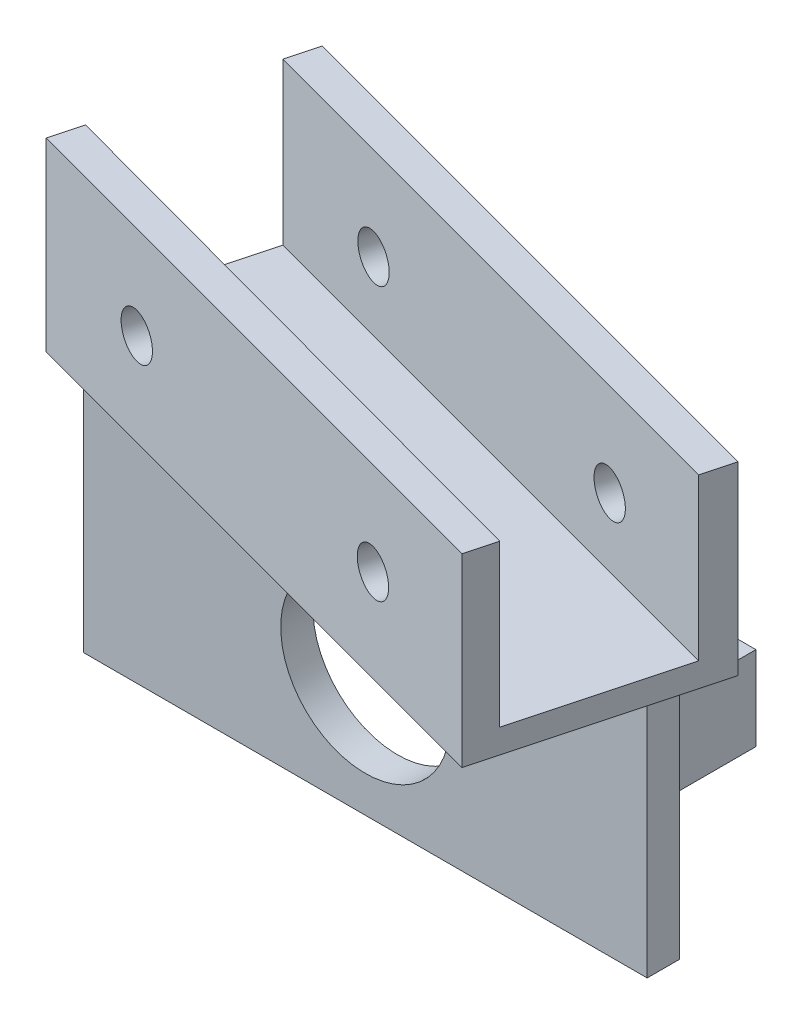
ISO-10303-21;
HEADER;
FILE_DESCRIPTION(('STEP AP214'),'2;1');
FILE_NAME('part.step','',(''),(''),'','','');
FILE_SCHEMA(('AUTOMOTIVE_DESIGN { 1 0 10303 214 1 1 1 1 }'));
ENDSEC;
DATA;
#1=APPLICATION_CONTEXT('core data for automotive mechanical design processes');
#2=APPLICATION_PROTOCOL_DEFINITION('international standard','automotive_design',2000,#1);
#3=PRODUCT_CONTEXT('',#1,'mechanical');
#4=PRODUCT('Part','Part','',(#3));
#5=PRODUCT_RELATED_PRODUCT_CATEGORY('part','',(#4));
#6=PRODUCT_DEFINITION_FORMATION('','',#4);
#7=PRODUCT_DEFINITION_CONTEXT('part definition',#1,'design');
#8=PRODUCT_DEFINITION('design','',#6,#7);
#9=PRODUCT_DEFINITION_SHAPE('','',#8);
#10=(LENGTH_UNIT() NAMED_UNIT(*) SI_UNIT(.MILLI.,.METRE.));
#11=(NAMED_UNIT(*) PLANE_ANGLE_UNIT() SI_UNIT($,.RADIAN.));
#12=(NAMED_UNIT(*) SI_UNIT($,.STERADIAN.) SOLID_ANGLE_UNIT());
#13=UNCERTAINTY_MEASURE_WITH_UNIT(LENGTH_MEASURE(1.E-05),#10,'distance_accuracy_value','');
#14=(GEOMETRIC_REPRESENTATION_CONTEXT(3) GLOBAL_UNCERTAINTY_ASSIGNED_CONTEXT((#13)) GLOBAL_UNIT_ASSIGNED_CONTEXT((#10,
#11,#12)) REPRESENTATION_CONTEXT('',''));
#15=CARTESIAN_POINT('',(0.,0.,0.));
#16=DIRECTION('',(0.,0.,1.));
#17=DIRECTION('',(1.,0.,0.));
#18=AXIS2_PLACEMENT_3D('',#15,#16,#17);
#19=CARTESIAN_POINT('',(0.,0.,0.));
#20=DIRECTION('',(0.,0.,1.));
#21=DIRECTION('',(1.,0.,0.));
#22=AXIS2_PLACEMENT_3D('',#19,#20,#21);
#23=PLANE('',#22);
#24=DIRECTION('',(0.,-1.,0.));
#25=VECTOR('',#24,1.);
#26=CARTESIAN_POINT('',(62.5000000000001,-8.93838300419958,0.));
#27=LINE('',#26,#25);
#28=CARTESIAN_POINT('',(62.5000000000001,-8.93838300419958,0.));
#29=VERTEX_POINT('',#28);
#30=CARTESIAN_POINT('',(62.5000000000001,-19.3737653444259,0.));
#31=VERTEX_POINT('',#30);
#32=EDGE_CURVE('E281',#29,#31,#27,.T.);
#33=ORIENTED_EDGE('',*,*,#32,.F.);
#34=DIRECTION('',(1.,0.,0.));
#35=VECTOR('',#34,1.);
#36=CARTESIAN_POINT('',(62.5000000000001,-8.93838300419958,0.));
#37=LINE('',#36,#35);
#38=CARTESIAN_POINT('',(54.3490123333825,-8.93838300419958,0.));
#39=VERTEX_POINT('',#38);
#40=EDGE_CURVE('E314',#39,#29,#37,.T.);
#41=ORIENTED_EDGE('',*,*,#40,.F.);
#42=DIRECTION('',(0.,1.,0.));
#43=VECTOR('',#42,1.);
#44=CARTESIAN_POINT('',(54.3490123333825,-8.93838300419958,0.));
#45=LINE('',#44,#43);
#46=CARTESIAN_POINT('',(54.3490123333825,-19.3737653444259,0.));
#47=VERTEX_POINT('',#46);
#48=EDGE_CURVE('E319',#47,#39,#45,.T.);
#49=ORIENTED_EDGE('',*,*,#48,.F.);
#50=DIRECTION('',(-1.,0.,0.));
#51=VECTOR('',#50,1.);
#52=CARTESIAN_POINT('',(54.3490123333825,-19.3737653444259,0.));
#53=LINE('',#52,#51);
#54=EDGE_CURVE('E325',#31,#47,#53,.T.);
#55=ORIENTED_EDGE('',*,*,#54,.F.);
#56=EDGE_LOOP('',(#33,#41,#49,#55));
#57=FACE_BOUND('',#56,.T.);
#58=DIRECTION('',(0.,-1.,0.));
#59=VECTOR('',#58,1.);
#60=CARTESIAN_POINT('',(0.,0.,0.));
#61=LINE('',#60,#59);
#62=CARTESIAN_POINT('',(0.,0.,0.));
#63=VERTEX_POINT('',#62);
#64=CARTESIAN_POINT('',(0.,-30.,0.));
#65=VERTEX_POINT('',#64);
#66=EDGE_CURVE('E340',#63,#65,#61,.T.);
#67=ORIENTED_EDGE('',*,*,#66,.F.);
#68=DIRECTION('',(-1.,0.,0.));
#69=VECTOR('',#68,1.);
#70=CARTESIAN_POINT('',(0.,0.,0.));
#71=LINE('',#70,#69);
#72=CARTESIAN_POINT('',(70.,0.,0.));
#73=VERTEX_POINT('',#72);
#74=EDGE_CURVE('E341',#73,#63,#71,.T.);
#75=ORIENTED_EDGE('',*,*,#74,.F.);
#76=DIRECTION('',(0.,1.,0.));
#77=VECTOR('',#76,1.);
#78=CARTESIAN_POINT('',(70.,0.,0.));
#79=LINE('',#78,#77);
#80=CARTESIAN_POINT('',(70.,-30.,0.));
#81=VERTEX_POINT('',#80);
#82=EDGE_CURVE('E352',#81,#73,#79,.T.);
#83=ORIENTED_EDGE('',*,*,#82,.F.);
#84=DIRECTION('',(1.,0.,0.));
#85=VECTOR('',#84,1.);
#86=CARTESIAN_POINT('',(0.,-30.,0.));
#87=LINE('',#86,#85);
#88=EDGE_CURVE('E351',#65,#81,#87,.T.);
#89=ORIENTED_EDGE('',*,*,#88,.F.);
#90=EDGE_LOOP('',(#67,#75,#83,#89));
#91=FACE_BOUND('',#90,.T.);
#92=CARTESIAN_POINT('',(35.,-15.,0.));
#93=DIRECTION('',(0.,0.,1.));
#94=DIRECTION('',(1.,0.,0.));
#95=AXIS2_PLACEMENT_3D('',#92,#93,#94);
#96=CIRCLE('',#95,10.5);
#97=CARTESIAN_POINT('',(45.5,-15.,0.));
#98=VERTEX_POINT('',#97);
#99=EDGE_CURVE('E305',#98,#98,#96,.T.);
#100=ORIENTED_EDGE('',*,*,#99,.T.);
#101=EDGE_LOOP('',(#100));
#102=FACE_BOUND('',#101,.T.);
#103=DIRECTION('',(0.,1.,0.));
#104=VECTOR('',#103,1.);
#105=CARTESIAN_POINT('',(7.50000000000006,-25.,0.));
#106=LINE('',#105,#104);
#107=CARTESIAN_POINT('',(7.50000000000006,-25.,0.));
#108=VERTEX_POINT('',#107);
#109=CARTESIAN_POINT('',(7.50000000000006,-5.00000000000002,0.));
#110=VERTEX_POINT('',#109);
#111=EDGE_CURVE('E276',#108,#110,#106,.T.);
#112=ORIENTED_EDGE('',*,*,#111,.F.);
#113=DIRECTION('',(-1.,0.,0.));
#114=VECTOR('',#113,1.);
#115=CARTESIAN_POINT('',(14.3209161154327,-25.,0.));
#116=LINE('',#115,#114);
#117=CARTESIAN_POINT('',(14.3209161154327,-25.,0.));
#118=VERTEX_POINT('',#117);
#119=EDGE_CURVE('E275',#118,#108,#116,.T.);
#120=ORIENTED_EDGE('',*,*,#119,.F.);
#121=DIRECTION('',(0.,-1.,0.));
#122=VECTOR('',#121,1.);
#123=CARTESIAN_POINT('',(14.3209161154327,-5.00000000000002,0.));
#124=LINE('',#123,#122);
#125=CARTESIAN_POINT('',(14.3209161154327,-5.00000000000002,0.));
#126=VERTEX_POINT('',#125);
#127=EDGE_CURVE('E288',#126,#118,#124,.T.);
#128=ORIENTED_EDGE('',*,*,#127,.F.);
#129=DIRECTION('',(1.,0.,0.));
#130=VECTOR('',#129,1.);
#131=CARTESIAN_POINT('',(7.50000000000006,-5.00000000000002,0.));
#132=LINE('',#131,#130);
#133=EDGE_CURVE('E285',#110,#126,#132,.T.);
#134=ORIENTED_EDGE('',*,*,#133,.F.);
#135=EDGE_LOOP('',(#112,#120,#128,#134));
#136=FACE_BOUND('',#135,.T.);
#137=ADVANCED_FACE('F39',(#57,#91,#102,#136),#23,.F.);
#138=CARTESIAN_POINT('',(0.,0.,4.));
#139=DIRECTION('',(0.,0.,1.));
#140=DIRECTION('',(1.,0.,0.));
#141=AXIS2_PLACEMENT_3D('',#138,#139,#140);
#142=PLANE('',#141);
#143=DIRECTION('',(0.,-1.,0.));
#144=VECTOR('',#143,1.);
#145=CARTESIAN_POINT('',(0.,0.,4.));
#146=LINE('',#145,#144);
#147=CARTESIAN_POINT('',(0.,0.,4.));
#148=VERTEX_POINT('',#147);
#149=CARTESIAN_POINT('',(0.,-30.,4.));
#150=VERTEX_POINT('',#149);
#151=EDGE_CURVE('E338',#148,#150,#146,.T.);
#152=ORIENTED_EDGE('',*,*,#151,.T.);
#153=DIRECTION('',(1.,0.,0.));
#154=VECTOR('',#153,1.);
#155=CARTESIAN_POINT('',(0.,-30.,4.));
#156=LINE('',#155,#154);
#157=CARTESIAN_POINT('',(70.,-30.,4.));
#158=VERTEX_POINT('',#157);
#159=EDGE_CURVE('E344',#150,#158,#156,.T.);
#160=ORIENTED_EDGE('',*,*,#159,.T.);
#161=DIRECTION('',(0.,1.,0.));
#162=VECTOR('',#161,1.);
#163=CARTESIAN_POINT('',(70.,0.,4.));
#164=LINE('',#163,#162);
#165=CARTESIAN_POINT('',(70.,0.,4.));
#166=VERTEX_POINT('',#165);
#167=EDGE_CURVE('E348',#158,#166,#164,.T.);
#168=ORIENTED_EDGE('',*,*,#167,.T.);
#169=DIRECTION('',(-1.,0.,0.));
#170=VECTOR('',#169,1.);
#171=CARTESIAN_POINT('',(0.,0.,4.));
#172=LINE('',#171,#170);
#173=EDGE_CURVE('E346',#166,#148,#172,.T.);
#174=ORIENTED_EDGE('',*,*,#173,.T.);
#175=EDGE_LOOP('',(#152,#160,#168,#174));
#176=FACE_BOUND('',#175,.T.);
#177=CARTESIAN_POINT('',(35.,-15.,4.));
#178=DIRECTION('',(0.,0.,1.));
#179=DIRECTION('',(1.,0.,0.));
#180=AXIS2_PLACEMENT_3D('',#177,#178,#179);
#181=CIRCLE('',#180,10.5);
#182=CARTESIAN_POINT('',(45.5,-15.,4.));
#183=VERTEX_POINT('',#182);
#184=EDGE_CURVE('E334',#183,#183,#181,.T.);
#185=ORIENTED_EDGE('',*,*,#184,.F.);
#186=EDGE_LOOP('',(#185));
#187=FACE_BOUND('',#186,.T.);
#188=ADVANCED_FACE('F419',(#176,#187),#142,.T.);
#189=CARTESIAN_POINT('',(0.,0.,4.));
#190=DIRECTION('',(1.,0.,0.));
#191=DIRECTION('',(0.,1.,0.));
#192=AXIS2_PLACEMENT_3D('',#189,#190,#191);
#193=PLANE('',#192);
#194=ORIENTED_EDGE('',*,*,#66,.T.);
#195=DIRECTION('',(0.,0.,-1.));
#196=VECTOR('',#195,1.);
#197=CARTESIAN_POINT('',(0.,-30.,4.));
#198=LINE('',#197,#196);
#199=EDGE_CURVE('E11',#150,#65,#198,.T.);
#200=ORIENTED_EDGE('',*,*,#199,.F.);
#201=ORIENTED_EDGE('',*,*,#151,.F.);
#202=DIRECTION('',(0.,0.,-1.));
#203=VECTOR('',#202,1.);
#204=CARTESIAN_POINT('',(0.,0.,4.));
#205=LINE('',#204,#203);
#206=EDGE_CURVE('E349',#148,#63,#205,.T.);
#207=ORIENTED_EDGE('',*,*,#206,.T.);
#208=EDGE_LOOP('',(#194,#200,#201,#207));
#209=FACE_BOUND('',#208,.T.);
#210=ADVANCED_FACE('F41',(#209),#193,.F.);
#211=CARTESIAN_POINT('',(0.,-30.,4.));
#212=DIRECTION('',(0.,1.,0.));
#213=DIRECTION('',(0.,0.,1.));
#214=AXIS2_PLACEMENT_3D('',#211,#212,#213);
#215=PLANE('',#214);
#216=ORIENTED_EDGE('',*,*,#88,.T.);
#217=DIRECTION('',(0.,0.,-1.));
#218=VECTOR('',#217,1.);
#219=CARTESIAN_POINT('',(70.,-30.,4.));
#220=LINE('',#219,#218);
#221=EDGE_CURVE('E48',#158,#81,#220,.T.);
#222=ORIENTED_EDGE('',*,*,#221,.F.);
#223=ORIENTED_EDGE('',*,*,#159,.F.);
#224=ORIENTED_EDGE('',*,*,#199,.T.);
#225=EDGE_LOOP('',(#216,#222,#223,#224));
#226=FACE_BOUND('',#225,.T.);
#227=ADVANCED_FACE('F432',(#226),#215,.F.);
#228=CARTESIAN_POINT('',(70.,0.,4.));
#229=DIRECTION('',(-1.,0.,0.));
#230=DIRECTION('',(0.,0.,1.));
#231=AXIS2_PLACEMENT_3D('',#228,#229,#230);
#232=PLANE('',#231);
#233=ORIENTED_EDGE('',*,*,#82,.T.);
#234=DIRECTION('',(0.,0.,-1.));
#235=VECTOR('',#234,1.);
#236=CARTESIAN_POINT('',(70.,0.,4.));
#237=LINE('',#236,#235);
#238=EDGE_CURVE('E363',#166,#73,#237,.T.);
#239=ORIENTED_EDGE('',*,*,#238,.F.);
#240=ORIENTED_EDGE('',*,*,#167,.F.);
#241=ORIENTED_EDGE('',*,*,#221,.T.);
#242=EDGE_LOOP('',(#233,#239,#240,#241));
#243=FACE_BOUND('',#242,.T.);
#244=ADVANCED_FACE('F431',(#243),#232,.F.);
#245=CARTESIAN_POINT('',(35.,-15.,4.));
#246=DIRECTION('',(0.,0.,-1.));
#247=DIRECTION('',(-1.,0.,0.));
#248=AXIS2_PLACEMENT_3D('',#245,#246,#247);
#249=CYLINDRICAL_SURFACE('',#248,10.5);
#250=ORIENTED_EDGE('',*,*,#184,.T.);
#251=EDGE_LOOP('',(#250));
#252=FACE_BOUND('',#251,.T.);
#253=ORIENTED_EDGE('',*,*,#99,.F.);
#254=EDGE_LOOP('',(#253));
#255=FACE_BOUND('',#254,.T.);
#256=ADVANCED_FACE('F433',(#252,#255),#249,.F.);
#257=CARTESIAN_POINT('',(62.5000000000001,-8.93838300419958,-17.));
#258=DIRECTION('',(-1.,0.,0.));
#259=DIRECTION('',(0.,0.,1.));
#260=AXIS2_PLACEMENT_3D('',#257,#258,#259);
#261=PLANE('',#260);
#262=ORIENTED_EDGE('',*,*,#32,.T.);
#263=DIRECTION('',(0.,0.,1.));
#264=VECTOR('',#263,1.);
#265=CARTESIAN_POINT('',(62.5000000000001,-19.3737653444259,-17.));
#266=LINE('',#265,#264);
#267=CARTESIAN_POINT('',(62.5000000000001,-19.3737653444259,-17.));
#268=VERTEX_POINT('',#267);
#269=EDGE_CURVE('E254',#268,#31,#266,.T.);
#270=ORIENTED_EDGE('',*,*,#269,.F.);
#271=DIRECTION('',(0.,-1.,0.));
#272=VECTOR('',#271,1.);
#273=CARTESIAN_POINT('',(62.5000000000001,-8.93838300419958,-17.));
#274=LINE('',#273,#272);
#275=CARTESIAN_POINT('',(62.5000000000001,-8.93838300419958,-17.));
#276=VERTEX_POINT('',#275);
#277=EDGE_CURVE('E316',#276,#268,#274,.T.);
#278=ORIENTED_EDGE('',*,*,#277,.F.);
#279=DIRECTION('',(0.,0.,1.));
#280=VECTOR('',#279,1.);
#281=CARTESIAN_POINT('',(62.5000000000001,-8.93838300419958,-17.));
#282=LINE('',#281,#280);
#283=EDGE_CURVE('E311',#276,#29,#282,.T.);
#284=ORIENTED_EDGE('',*,*,#283,.T.);
#285=EDGE_LOOP('',(#262,#270,#278,#284));
#286=FACE_BOUND('',#285,.T.);
#287=ADVANCED_FACE('F457',(#286),#261,.F.);
#288=CARTESIAN_POINT('',(54.3490123333825,-19.3737653444259,-17.));
#289=DIRECTION('',(0.,1.,0.));
#290=DIRECTION('',(0.,0.,1.));
#291=AXIS2_PLACEMENT_3D('',#288,#289,#290);
#292=PLANE('',#291);
#293=ORIENTED_EDGE('',*,*,#54,.T.);
#294=DIRECTION('',(0.,0.,1.));
#295=VECTOR('',#294,1.);
#296=CARTESIAN_POINT('',(54.3490123333825,-19.3737653444259,-17.));
#297=LINE('',#296,#295);
#298=CARTESIAN_POINT('',(54.3490123333825,-19.3737653444259,-17.));
#299=VERTEX_POINT('',#298);
#300=EDGE_CURVE('E304',#299,#47,#297,.T.);
#301=ORIENTED_EDGE('',*,*,#300,.F.);
#302=DIRECTION('',(-1.,0.,0.));
#303=VECTOR('',#302,1.);
#304=CARTESIAN_POINT('',(54.3490123333825,-19.3737653444259,-17.));
#305=LINE('',#304,#303);
#306=EDGE_CURVE('E329',#268,#299,#305,.T.);
#307=ORIENTED_EDGE('',*,*,#306,.F.);
#308=ORIENTED_EDGE('',*,*,#269,.T.);
#309=EDGE_LOOP('',(#293,#301,#307,#308));
#310=FACE_BOUND('',#309,.T.);
#311=ADVANCED_FACE('F495',(#310),#292,.F.);
#312=CARTESIAN_POINT('',(54.3490123333825,-8.93838300419958,-17.));
#313=DIRECTION('',(1.,0.,0.));
#314=DIRECTION('',(0.,0.,-1.));
#315=AXIS2_PLACEMENT_3D('',#312,#313,#314);
#316=PLANE('',#315);
#317=ORIENTED_EDGE('',*,*,#48,.T.);
#318=DIRECTION('',(0.,0.,1.));
#319=VECTOR('',#318,1.);
#320=CARTESIAN_POINT('',(54.3490123333825,-8.93838300419958,-17.));
#321=LINE('',#320,#319);
#322=CARTESIAN_POINT('',(54.3490123333825,-8.93838300419958,-17.));
#323=VERTEX_POINT('',#322);
#324=EDGE_CURVE('E308',#323,#39,#321,.T.);
#325=ORIENTED_EDGE('',*,*,#324,.F.);
#326=DIRECTION('',(0.,1.,0.));
#327=VECTOR('',#326,1.);
#328=CARTESIAN_POINT('',(54.3490123333825,-8.93838300419958,-17.));
#329=LINE('',#328,#327);
#330=EDGE_CURVE('E326',#299,#323,#329,.T.);
#331=ORIENTED_EDGE('',*,*,#330,.F.);
#332=ORIENTED_EDGE('',*,*,#300,.T.);
#333=EDGE_LOOP('',(#317,#325,#331,#332));
#334=FACE_BOUND('',#333,.T.);
#335=ADVANCED_FACE('F496',(#334),#316,.F.);
#336=CARTESIAN_POINT('',(62.5000000000001,-8.93838300419958,-17.));
#337=DIRECTION('',(0.,-1.,0.));
#338=DIRECTION('',(0.,0.,-1.));
#339=AXIS2_PLACEMENT_3D('',#336,#337,#338);
#340=PLANE('',#339);
#341=ORIENTED_EDGE('',*,*,#40,.T.);
#342=ORIENTED_EDGE('',*,*,#283,.F.);
#343=DIRECTION('',(1.,0.,0.));
#344=VECTOR('',#343,1.);
#345=CARTESIAN_POINT('',(62.5000000000001,-8.93838300419958,-17.));
#346=LINE('',#345,#344);
#347=EDGE_CURVE('E313',#323,#276,#346,.T.);
#348=ORIENTED_EDGE('',*,*,#347,.F.);
#349=ORIENTED_EDGE('',*,*,#324,.T.);
#350=EDGE_LOOP('',(#341,#342,#348,#349));
#351=FACE_BOUND('',#350,.T.);
#352=ADVANCED_FACE('F499',(#351),#340,.F.);
#353=CARTESIAN_POINT('',(0.,0.,-17.));
#354=DIRECTION('',(0.,0.,1.));
#355=DIRECTION('',(1.,0.,0.));
#356=AXIS2_PLACEMENT_3D('',#353,#354,#355);
#357=PLANE('',#356);
#358=CARTESIAN_POINT('',(58.5000000000001,-14.2890995260664,-17.));
#359=DIRECTION('',(0.,0.,-1.));
#360=DIRECTION('',(-1.,0.,0.));
#361=AXIS2_PLACEMENT_3D('',#358,#359,#360);
#362=CIRCLE('',#361,0.999999999999998);
#363=CARTESIAN_POINT('',(57.5000000000001,-14.2890995260664,-17.));
#364=VERTEX_POINT('',#363);
#365=EDGE_CURVE('E251',#364,#364,#362,.T.);
#366=ORIENTED_EDGE('',*,*,#365,.F.);
#367=EDGE_LOOP('',(#366));
#368=FACE_BOUND('',#367,.T.);
#369=ORIENTED_EDGE('',*,*,#277,.T.);
#370=ORIENTED_EDGE('',*,*,#306,.T.);
#371=ORIENTED_EDGE('',*,*,#330,.T.);
#372=ORIENTED_EDGE('',*,*,#347,.T.);
#373=EDGE_LOOP('',(#369,#370,#371,#372));
#374=FACE_BOUND('',#373,.T.);
#375=ADVANCED_FACE('F488',(#368,#374),#357,.F.);
#376=CARTESIAN_POINT('',(7.50000000000006,-25.,-17.));
#377=DIRECTION('',(1.,0.,0.));
#378=DIRECTION('',(0.,0.,-1.));
#379=AXIS2_PLACEMENT_3D('',#376,#377,#378);
#380=PLANE('',#379);
#381=ORIENTED_EDGE('',*,*,#111,.T.);
#382=DIRECTION('',(0.,0.,1.));
#383=VECTOR('',#382,1.);
#384=CARTESIAN_POINT('',(7.50000000000006,-5.00000000000002,-17.));
#385=LINE('',#384,#383);
#386=CARTESIAN_POINT('',(7.50000000000006,-5.00000000000002,-17.));
#387=VERTEX_POINT('',#386);
#388=EDGE_CURVE('E299',#387,#110,#385,.T.);
#389=ORIENTED_EDGE('',*,*,#388,.F.);
#390=DIRECTION('',(0.,1.,0.));
#391=VECTOR('',#390,1.);
#392=CARTESIAN_POINT('',(7.50000000000006,-25.,-17.));
#393=LINE('',#392,#391);
#394=CARTESIAN_POINT('',(7.50000000000006,-25.,-17.));
#395=VERTEX_POINT('',#394);
#396=EDGE_CURVE('E266',#395,#387,#393,.T.);
#397=ORIENTED_EDGE('',*,*,#396,.F.);
#398=DIRECTION('',(0.,0.,1.));
#399=VECTOR('',#398,1.);
#400=CARTESIAN_POINT('',(7.50000000000006,-25.,-17.));
#401=LINE('',#400,#399);
#402=EDGE_CURVE('E279',#395,#108,#401,.T.);
#403=ORIENTED_EDGE('',*,*,#402,.T.);
#404=EDGE_LOOP('',(#381,#389,#397,#403));
#405=FACE_BOUND('',#404,.T.);
#406=ADVANCED_FACE('F468',(#405),#380,.F.);
#407=CARTESIAN_POINT('',(7.50000000000006,-5.00000000000002,-17.));
#408=DIRECTION('',(0.,-1.,0.));
#409=DIRECTION('',(0.,0.,-1.));
#410=AXIS2_PLACEMENT_3D('',#407,#408,#409);
#411=PLANE('',#410);
#412=ORIENTED_EDGE('',*,*,#133,.T.);
#413=DIRECTION('',(0.,0.,1.));
#414=VECTOR('',#413,1.);
#415=CARTESIAN_POINT('',(14.3209161154327,-5.00000000000002,-17.));
#416=LINE('',#415,#414);
#417=CARTESIAN_POINT('',(14.3209161154327,-5.00000000000002,-17.));
#418=VERTEX_POINT('',#417);
#419=EDGE_CURVE('E298',#418,#126,#416,.T.);
#420=ORIENTED_EDGE('',*,*,#419,.F.);
#421=DIRECTION('',(1.,0.,0.));
#422=VECTOR('',#421,1.);
#423=CARTESIAN_POINT('',(7.50000000000006,-5.00000000000002,-17.));
#424=LINE('',#423,#422);
#425=EDGE_CURVE('E272',#387,#418,#424,.T.);
#426=ORIENTED_EDGE('',*,*,#425,.F.);
#427=ORIENTED_EDGE('',*,*,#388,.T.);
#428=EDGE_LOOP('',(#412,#420,#426,#427));
#429=FACE_BOUND('',#428,.T.);
#430=ADVANCED_FACE('F476',(#429),#411,.F.);
#431=CARTESIAN_POINT('',(14.3209161154327,-5.00000000000002,-17.));
#432=DIRECTION('',(-1.,0.,0.));
#433=DIRECTION('',(0.,-1.,0.));
#434=AXIS2_PLACEMENT_3D('',#431,#432,#433);
#435=PLANE('',#434);
#436=ORIENTED_EDGE('',*,*,#127,.T.);
#437=DIRECTION('',(0.,0.,1.));
#438=VECTOR('',#437,1.);
#439=CARTESIAN_POINT('',(14.3209161154327,-25.,-17.));
#440=LINE('',#439,#438);
#441=CARTESIAN_POINT('',(14.3209161154327,-25.,-17.));
#442=VERTEX_POINT('',#441);
#443=EDGE_CURVE('E291',#442,#118,#440,.T.);
#444=ORIENTED_EDGE('',*,*,#443,.F.);
#445=DIRECTION('',(0.,-1.,0.));
#446=VECTOR('',#445,1.);
#447=CARTESIAN_POINT('',(14.3209161154327,-5.00000000000002,-17.));
#448=LINE('',#447,#446);
#449=EDGE_CURVE('E274',#418,#442,#448,.T.);
#450=ORIENTED_EDGE('',*,*,#449,.F.);
#451=ORIENTED_EDGE('',*,*,#419,.T.);
#452=EDGE_LOOP('',(#436,#444,#450,#451));
#453=FACE_BOUND('',#452,.T.);
#454=ADVANCED_FACE('F478',(#453),#435,.F.);
#455=CARTESIAN_POINT('',(14.3209161154327,-25.,-17.));
#456=DIRECTION('',(0.,1.,0.));
#457=DIRECTION('',(0.,0.,1.));
#458=AXIS2_PLACEMENT_3D('',#455,#456,#457);
#459=PLANE('',#458);
#460=ORIENTED_EDGE('',*,*,#119,.T.);
#461=ORIENTED_EDGE('',*,*,#402,.F.);
#462=DIRECTION('',(-1.,0.,0.));
#463=VECTOR('',#462,1.);
#464=CARTESIAN_POINT('',(14.3209161154327,-25.,-17.));
#465=LINE('',#464,#463);
#466=EDGE_CURVE('E277',#442,#395,#465,.T.);
#467=ORIENTED_EDGE('',*,*,#466,.F.);
#468=ORIENTED_EDGE('',*,*,#443,.T.);
#469=EDGE_LOOP('',(#460,#461,#467,#468));
#470=FACE_BOUND('',#469,.T.);
#471=ADVANCED_FACE('F467',(#470),#459,.F.);
#472=CARTESIAN_POINT('',(0.,0.,-17.));
#473=DIRECTION('',(0.,0.,-1.));
#474=DIRECTION('',(-1.,0.,0.));
#475=AXIS2_PLACEMENT_3D('',#472,#473,#474);
#476=PLANE('',#475);
#477=CARTESIAN_POINT('',(11.5000000000001,-7.00000000000002,-17.));
#478=DIRECTION('',(0.,0.,-1.));
#479=DIRECTION('',(-1.,0.,0.));
#480=AXIS2_PLACEMENT_3D('',#477,#478,#479);
#481=CIRCLE('',#480,1.);
#482=CARTESIAN_POINT('',(10.5000000000001,-7.00000000000002,-17.));
#483=VERTEX_POINT('',#482);
#484=EDGE_CURVE('E260',#483,#483,#481,.T.);
#485=ORIENTED_EDGE('',*,*,#484,.F.);
#486=EDGE_LOOP('',(#485));
#487=FACE_BOUND('',#486,.T.);
#488=CARTESIAN_POINT('',(11.5000000000001,-23.,-17.));
#489=DIRECTION('',(0.,0.,-1.));
#490=DIRECTION('',(-1.,0.,0.));
#491=AXIS2_PLACEMENT_3D('',#488,#489,#490);
#492=CIRCLE('',#491,1.);
#493=CARTESIAN_POINT('',(10.5000000000001,-23.,-17.));
#494=VERTEX_POINT('',#493);
#495=EDGE_CURVE('E261',#494,#494,#492,.T.);
#496=ORIENTED_EDGE('',*,*,#495,.F.);
#497=EDGE_LOOP('',(#496));
#498=FACE_BOUND('',#497,.T.);
#499=ORIENTED_EDGE('',*,*,#396,.T.);
#500=ORIENTED_EDGE('',*,*,#425,.T.);
#501=ORIENTED_EDGE('',*,*,#449,.T.);
#502=ORIENTED_EDGE('',*,*,#466,.T.);
#503=EDGE_LOOP('',(#499,#500,#501,#502));
#504=FACE_BOUND('',#503,.T.);
#505=ADVANCED_FACE('F475',(#487,#498,#504),#476,.T.);
#506=CARTESIAN_POINT('',(11.5000000000001,-23.,0.));
#507=DIRECTION('',(0.,0.,-1.));
#508=DIRECTION('',(-1.,0.,0.));
#509=AXIS2_PLACEMENT_3D('',#506,#507,#508);
#510=CYLINDRICAL_SURFACE('',#509,1.);
#511=CARTESIAN_POINT('',(11.5000000000001,-23.,0.));
#512=DIRECTION('',(0.,0.,-1.));
#513=DIRECTION('',(-1.,0.,0.));
#514=AXIS2_PLACEMENT_3D('',#511,#512,#513);
#515=CIRCLE('',#514,1.);
#516=CARTESIAN_POINT('',(10.5000000000001,-23.,0.));
#517=VERTEX_POINT('',#516);
#518=EDGE_CURVE('E189',#517,#517,#515,.T.);
#519=ORIENTED_EDGE('',*,*,#518,.F.);
#520=EDGE_LOOP('',(#519));
#521=FACE_BOUND('',#520,.T.);
#522=ORIENTED_EDGE('',*,*,#495,.T.);
#523=EDGE_LOOP('',(#522));
#524=FACE_BOUND('',#523,.T.);
#525=ADVANCED_FACE('F545',(#521,#524),#510,.F.);
#526=CARTESIAN_POINT('',(11.5000000000001,-23.,0.));
#527=DIRECTION('',(0.,0.,-1.));
#528=DIRECTION('',(-1.,0.,0.));
#529=AXIS2_PLACEMENT_3D('',#526,#527,#528);
#530=PLANE('',#529);
#531=ORIENTED_EDGE('',*,*,#518,.T.);
#532=EDGE_LOOP('',(#531));
#533=FACE_BOUND('',#532,.T.);
#534=ADVANCED_FACE('F536',(#533),#530,.T.);
#535=CARTESIAN_POINT('',(11.5000000000001,-7.00000000000002,0.));
#536=DIRECTION('',(0.,0.,-1.));
#537=DIRECTION('',(-1.,0.,0.));
#538=AXIS2_PLACEMENT_3D('',#535,#536,#537);
#539=CYLINDRICAL_SURFACE('',#538,1.);
#540=CARTESIAN_POINT('',(11.5000000000001,-7.00000000000002,0.));
#541=DIRECTION('',(0.,0.,-1.));
#542=DIRECTION('',(-1.,0.,0.));
#543=AXIS2_PLACEMENT_3D('',#540,#541,#542);
#544=CIRCLE('',#543,1.);
#545=CARTESIAN_POINT('',(10.5000000000001,-7.00000000000002,0.));
#546=VERTEX_POINT('',#545);
#547=EDGE_CURVE('E258',#546,#546,#544,.T.);
#548=ORIENTED_EDGE('',*,*,#547,.F.);
#549=EDGE_LOOP('',(#548));
#550=FACE_BOUND('',#549,.T.);
#551=ORIENTED_EDGE('',*,*,#484,.T.);
#552=EDGE_LOOP('',(#551));
#553=FACE_BOUND('',#552,.T.);
#554=ADVANCED_FACE('F535',(#550,#553),#539,.F.);
#555=CARTESIAN_POINT('',(11.5000000000001,-7.00000000000002,0.));
#556=DIRECTION('',(0.,0.,-1.));
#557=DIRECTION('',(-1.,0.,0.));
#558=AXIS2_PLACEMENT_3D('',#555,#556,#557);
#559=PLANE('',#558);
#560=ORIENTED_EDGE('',*,*,#547,.T.);
#561=EDGE_LOOP('',(#560));
#562=FACE_BOUND('',#561,.T.);
#563=ADVANCED_FACE('F522',(#562),#559,.T.);
#564=CARTESIAN_POINT('',(58.5000000000001,-14.2890995260664,0.));
#565=DIRECTION('',(0.,0.,-1.));
#566=DIRECTION('',(-1.,0.,0.));
#567=AXIS2_PLACEMENT_3D('',#564,#565,#566);
#568=CYLINDRICAL_SURFACE('',#567,0.999999999999998);
#569=CARTESIAN_POINT('',(58.5000000000001,-14.2890995260664,0.));
#570=DIRECTION('',(0.,0.,-1.));
#571=DIRECTION('',(-1.,0.,0.));
#572=AXIS2_PLACEMENT_3D('',#569,#570,#571);
#573=CIRCLE('',#572,0.999999999999998);
#574=CARTESIAN_POINT('',(57.5000000000001,-14.2890995260664,0.));
#575=VERTEX_POINT('',#574);
#576=EDGE_CURVE('E249',#575,#575,#573,.T.);
#577=ORIENTED_EDGE('',*,*,#576,.F.);
#578=EDGE_LOOP('',(#577));
#579=FACE_BOUND('',#578,.T.);
#580=ORIENTED_EDGE('',*,*,#365,.T.);
#581=EDGE_LOOP('',(#580));
#582=FACE_BOUND('',#581,.T.);
#583=ADVANCED_FACE('F523',(#579,#582),#568,.F.);
#584=CARTESIAN_POINT('',(58.5000000000001,-14.2890995260664,0.));
#585=DIRECTION('',(0.,0.,-1.));
#586=DIRECTION('',(-1.,0.,0.));
#587=AXIS2_PLACEMENT_3D('',#584,#585,#586);
#588=PLANE('',#587);
#589=ORIENTED_EDGE('',*,*,#576,.T.);
#590=EDGE_LOOP('',(#589));
#591=FACE_BOUND('',#590,.T.);
#592=ADVANCED_FACE('F521',(#591),#588,.T.);
#593=CARTESIAN_POINT('',(0.,0.,0.));
#594=DIRECTION('',(0.,1.,0.));
#595=DIRECTION('',(0.,0.,1.));
#596=AXIS2_PLACEMENT_3D('',#593,#594,#595);
#597=PLANE('',#596);
#598=DIRECTION('',(-0.258819045102515,0.,0.96592582628907));
#599=VECTOR('',#598,1.);
#600=CARTESIAN_POINT('',(-4.63036875734262,0.,4.));
#601=LINE('',#600,#599);
#602=CARTESIAN_POINT('',(2.61656450552779,0.,-23.0459231360939));
#603=VERTEX_POINT('',#602);
#604=CARTESIAN_POINT('',(-4.63036875734262,0.,4.));
#605=VERTEX_POINT('',#604);
#606=EDGE_CURVE('E187',#603,#605,#601,.T.);
#607=ORIENTED_EDGE('',*,*,#606,.F.);
#608=DIRECTION('',(-0.96592582628907,0.,-0.258819045102514));
#609=VECTOR('',#608,1.);
#610=CARTESIAN_POINT('',(73.1291498246299,0.,-4.15213284361039));
#611=LINE('',#610,#609);
#612=CARTESIAN_POINT('',(73.1291498246299,0.,-4.15213284361039));
#613=VERTEX_POINT('',#612);
#614=EDGE_CURVE('E236',#613,#603,#611,.T.);
#615=ORIENTED_EDGE('',*,*,#614,.F.);
#616=DIRECTION('',(0.258819045102514,0.,-0.96592582628907));
#617=VECTOR('',#616,1.);
#618=CARTESIAN_POINT('',(65.8822165617595,0.,22.8937902924836));
#619=LINE('',#618,#617);
#620=CARTESIAN_POINT('',(65.8822165617595,0.,22.8937902924836));
#621=VERTEX_POINT('',#620);
#622=EDGE_CURVE('E245',#621,#613,#619,.T.);
#623=ORIENTED_EDGE('',*,*,#622,.F.);
#624=DIRECTION('',(0.96592582628907,0.,0.258819045102515));
#625=VECTOR('',#624,1.);
#626=CARTESIAN_POINT('',(-4.63036875734262,0.,4.));
#627=LINE('',#626,#625);
#628=EDGE_CURVE('E239',#605,#621,#627,.T.);
#629=ORIENTED_EDGE('',*,*,#628,.F.);
#630=EDGE_LOOP('',(#607,#615,#623,#629));
#631=FACE_BOUND('',#630,.T.);
#632=ORIENTED_EDGE('',*,*,#238,.T.);
#633=ORIENTED_EDGE('',*,*,#74,.T.);
#634=ORIENTED_EDGE('',*,*,#206,.F.);
#635=ORIENTED_EDGE('',*,*,#173,.F.);
#636=EDGE_LOOP('',(#632,#633,#634,#635));
#637=FACE_BOUND('',#636,.T.);
#638=ADVANCED_FACE('F455',(#631,#637),#597,.F.);
#639=CARTESIAN_POINT('',(-4.63036875734262,3.,4.));
#640=DIRECTION('',(0.96592582628907,0.,0.258819045102515));
#641=DIRECTION('',(0.258819045102515,0.,-0.96592582628907));
#642=AXIS2_PLACEMENT_3D('',#639,#640,#641);
#643=PLANE('',#642);
#644=ORIENTED_EDGE('',*,*,#606,.T.);
#645=DIRECTION('',(0.,-1.,0.));
#646=VECTOR('',#645,1.);
#647=CARTESIAN_POINT('',(-4.63036875734262,3.,4.));
#648=LINE('',#647,#646);
#649=CARTESIAN_POINT('',(-4.63036875734262,23.,4.));
#650=VERTEX_POINT('',#649);
#651=EDGE_CURVE('E178',#650,#605,#648,.T.);
#652=ORIENTED_EDGE('',*,*,#651,.F.);
#653=DIRECTION('',(-0.258819045102514,0.,0.96592582628907));
#654=VECTOR('',#653,1.);
#655=CARTESIAN_POINT('',(-3.59509257693256,23.,0.13629669484372));
#656=LINE('',#655,#654);
#657=CARTESIAN_POINT('',(-3.59509257693256,23.,0.13629669484372));
#658=VERTEX_POINT('',#657);
#659=EDGE_CURVE('E182',#658,#650,#656,.T.);
#660=ORIENTED_EDGE('',*,*,#659,.F.);
#661=DIRECTION('',(0.,-1.,0.));
#662=VECTOR('',#661,1.);
#663=CARTESIAN_POINT('',(-3.59509257693256,23.,0.13629669484372));
#664=LINE('',#663,#662);
#665=CARTESIAN_POINT('',(-3.59509257693256,3.,0.13629669484372));
#666=VERTEX_POINT('',#665);
#667=EDGE_CURVE('E208',#658,#666,#664,.T.);
#668=ORIENTED_EDGE('',*,*,#667,.T.);
#669=DIRECTION('',(-0.258819045102515,0.,0.96592582628907));
#670=VECTOR('',#669,1.);
#671=CARTESIAN_POINT('',(-4.63036875734262,3.,4.));
#672=LINE('',#671,#670);
#673=CARTESIAN_POINT('',(1.58128832511773,3.,-19.1822198309376));
#674=VERTEX_POINT('',#673);
#675=EDGE_CURVE('E231',#674,#666,#672,.T.);
#676=ORIENTED_EDGE('',*,*,#675,.F.);
#677=DIRECTION('',(0.,-1.,0.));
#678=VECTOR('',#677,1.);
#679=CARTESIAN_POINT('',(1.58128832511773,23.,-19.1822198309377));
#680=LINE('',#679,#678);
#681=CARTESIAN_POINT('',(1.58128832511773,23.,-19.1822198309377));
#682=VERTEX_POINT('',#681);
#683=EDGE_CURVE('E218',#682,#674,#680,.T.);
#684=ORIENTED_EDGE('',*,*,#683,.F.);
#685=DIRECTION('',(-0.258819045102515,0.,0.96592582628907));
#686=VECTOR('',#685,1.);
#687=CARTESIAN_POINT('',(2.61656450552779,23.,-23.0459231360939));
#688=LINE('',#687,#686);
#689=CARTESIAN_POINT('',(2.61656450552779,23.,-23.0459231360939));
#690=VERTEX_POINT('',#689);
#691=EDGE_CURVE('E230',#690,#682,#688,.T.);
#692=ORIENTED_EDGE('',*,*,#691,.F.);
#693=DIRECTION('',(0.,-1.,0.));
#694=VECTOR('',#693,1.);
#695=CARTESIAN_POINT('',(2.61656450552779,3.,-23.0459231360939));
#696=LINE('',#695,#694);
#697=EDGE_CURVE('E238',#690,#603,#696,.T.);
#698=ORIENTED_EDGE('',*,*,#697,.T.);
#699=EDGE_LOOP('',(#644,#652,#660,#668,#676,#684,#692,#698));
#700=FACE_BOUND('',#699,.T.);
#701=ADVANCED_FACE('F179',(#700),#643,.F.);
#702=CARTESIAN_POINT('',(-4.63036875734262,3.,4.));
#703=DIRECTION('',(0.258819045102515,0.,-0.96592582628907));
#704=DIRECTION('',(-0.96592582628907,0.,-0.258819045102515));
#705=AXIS2_PLACEMENT_3D('',#702,#703,#704);
#706=PLANE('',#705);
#707=CARTESIAN_POINT('',(50.8051442271101,11.5,18.8539009361888));
#708=DIRECTION('',(0.258819045102515,0.,-0.96592582628907));
#709=DIRECTION('',(-0.96592582628907,0.,-0.258819045102515));
#710=AXIS2_PLACEMENT_3D('',#707,#708,#709);
#711=CIRCLE('',#710,2.75);
#712=CARTESIAN_POINT('',(48.1488482048152,11.5,18.1421485621568));
#713=VERTEX_POINT('',#712);
#714=EDGE_CURVE('E207',#713,#713,#711,.T.);
#715=ORIENTED_EDGE('',*,*,#714,.T.);
#716=EDGE_LOOP('',(#715));
#717=FACE_BOUND('',#716,.T.);
#718=CARTESIAN_POINT('',(10.7526197284578,11.5,8.12185934194737));
#719=DIRECTION('',(0.258819045102515,0.,-0.96592582628907));
#720=DIRECTION('',(-0.96592582628907,0.,-0.258819045102515));
#721=AXIS2_PLACEMENT_3D('',#718,#719,#720);
#722=CIRCLE('',#721,2.75);
#723=CARTESIAN_POINT('',(8.09632370616284,11.5,7.41010696791545));
#724=VERTEX_POINT('',#723);
#725=EDGE_CURVE('E375',#724,#724,#722,.T.);
#726=ORIENTED_EDGE('',*,*,#725,.T.);
#727=EDGE_LOOP('',(#726));
#728=FACE_BOUND('',#727,.T.);
#729=ORIENTED_EDGE('',*,*,#628,.T.);
#730=DIRECTION('',(0.,-1.,0.));
#731=VECTOR('',#730,1.);
#732=CARTESIAN_POINT('',(65.8822165617595,3.,22.8937902924836));
#733=LINE('',#732,#731);
#734=CARTESIAN_POINT('',(65.8822165617595,23.,22.8937902924836));
#735=VERTEX_POINT('',#734);
#736=EDGE_CURVE('E186',#735,#621,#733,.T.);
#737=ORIENTED_EDGE('',*,*,#736,.F.);
#738=DIRECTION('',(0.96592582628907,0.,0.258819045102515));
#739=VECTOR('',#738,1.);
#740=CARTESIAN_POINT('',(-4.63036875734262,23.,4.));
#741=LINE('',#740,#739);
#742=EDGE_CURVE('E195',#650,#735,#741,.T.);
#743=ORIENTED_EDGE('',*,*,#742,.F.);
#744=ORIENTED_EDGE('',*,*,#651,.T.);
#745=EDGE_LOOP('',(#729,#737,#743,#744));
#746=FACE_BOUND('',#745,.T.);
#747=ADVANCED_FACE('F194',(#717,#728,#746),#706,.F.);
#748=CARTESIAN_POINT('',(65.8822165617595,3.,22.8937902924836));
#749=DIRECTION('',(-0.96592582628907,0.,-0.258819045102514));
#750=DIRECTION('',(-0.258819045102514,0.,0.96592582628907));
#751=AXIS2_PLACEMENT_3D('',#748,#749,#750);
#752=PLANE('',#751);
#753=ORIENTED_EDGE('',*,*,#622,.T.);
#754=DIRECTION('',(0.,-1.,0.));
#755=VECTOR('',#754,1.);
#756=CARTESIAN_POINT('',(73.1291498246299,3.,-4.15213284361039));
#757=LINE('',#756,#755);
#758=CARTESIAN_POINT('',(73.1291498246299,23.,-4.15213284361039));
#759=VERTEX_POINT('',#758);
#760=EDGE_CURVE('E246',#759,#613,#757,.T.);
#761=ORIENTED_EDGE('',*,*,#760,.F.);
#762=DIRECTION('',(0.258819045102518,0.,-0.965925826289069));
#763=VECTOR('',#762,1.);
#764=CARTESIAN_POINT('',(72.0938736442198,23.,-0.288429538454101));
#765=LINE('',#764,#763);
#766=CARTESIAN_POINT('',(72.0938736442198,23.,-0.288429538454101));
#767=VERTEX_POINT('',#766);
#768=EDGE_CURVE('E225',#767,#759,#765,.T.);
#769=ORIENTED_EDGE('',*,*,#768,.F.);
#770=DIRECTION('',(0.,-1.,0.));
#771=VECTOR('',#770,1.);
#772=CARTESIAN_POINT('',(72.0938736442198,23.,-0.288429538454101));
#773=LINE('',#772,#771);
#774=CARTESIAN_POINT('',(72.0938736442198,3.,-0.288429538454101));
#775=VERTEX_POINT('',#774);
#776=EDGE_CURVE('E217',#767,#775,#773,.T.);
#777=ORIENTED_EDGE('',*,*,#776,.T.);
#778=DIRECTION('',(0.258819045102514,0.,-0.96592582628907));
#779=VECTOR('',#778,1.);
#780=CARTESIAN_POINT('',(65.8822165617595,3.,22.8937902924836));
#781=LINE('',#780,#779);
#782=CARTESIAN_POINT('',(66.8753779825093,3.,19.1872614101278));
#783=VERTEX_POINT('',#782);
#784=EDGE_CURVE('E232',#783,#775,#781,.T.);
#785=ORIENTED_EDGE('',*,*,#784,.F.);
#786=DIRECTION('',(0.,-1.,0.));
#787=VECTOR('',#786,1.);
#788=CARTESIAN_POINT('',(66.8753779825093,23.,19.1872614101278));
#789=LINE('',#788,#787);
#790=CARTESIAN_POINT('',(66.8753779825093,23.,19.1872614101278));
#791=VERTEX_POINT('',#790);
#792=EDGE_CURVE('E214',#791,#783,#789,.T.);
#793=ORIENTED_EDGE('',*,*,#792,.F.);
#794=DIRECTION('',(0.258819045102514,0.,-0.96592582628907));
#795=VECTOR('',#794,1.);
#796=CARTESIAN_POINT('',(65.8822165617595,23.,22.8937902924836));
#797=LINE('',#796,#795);
#798=EDGE_CURVE('E200',#735,#791,#797,.T.);
#799=ORIENTED_EDGE('',*,*,#798,.F.);
#800=ORIENTED_EDGE('',*,*,#736,.T.);
#801=EDGE_LOOP('',(#753,#761,#769,#777,#785,#793,#799,#800));
#802=FACE_BOUND('',#801,.T.);
#803=ADVANCED_FACE('F404',(#802),#752,.F.);
#804=CARTESIAN_POINT('',(73.1291498246299,3.,-4.15213284361039));
#805=DIRECTION('',(-0.258819045102514,0.,0.96592582628907));
#806=DIRECTION('',(0.96592582628907,0.,0.258819045102514));
#807=AXIS2_PLACEMENT_3D('',#804,#805,#806);
#808=PLANE('',#807);
#809=CARTESIAN_POINT('',(58.0520774899805,11.5,-8.19202219990522));
#810=DIRECTION('',(0.258819045102514,0.,-0.96592582628907));
#811=DIRECTION('',(-0.96592582628907,0.,-0.258819045102514));
#812=AXIS2_PLACEMENT_3D('',#809,#810,#811);
#813=CIRCLE('',#812,2.75);
#814=CARTESIAN_POINT('',(55.3957814676856,11.5,-8.90377457393714));
#815=VERTEX_POINT('',#814);
#816=EDGE_CURVE('E368',#815,#815,#813,.T.);
#817=ORIENTED_EDGE('',*,*,#816,.F.);
#818=EDGE_LOOP('',(#817));
#819=FACE_BOUND('',#818,.T.);
#820=CARTESIAN_POINT('',(17.9995529913282,11.5,-18.9240637941466));
#821=DIRECTION('',(0.258819045102514,0.,-0.96592582628907));
#822=DIRECTION('',(-0.96592582628907,0.,-0.258819045102514));
#823=AXIS2_PLACEMENT_3D('',#820,#821,#822);
#824=CIRCLE('',#823,2.75);
#825=CARTESIAN_POINT('',(15.3432569690332,11.5,-19.6358161681785));
#826=VERTEX_POINT('',#825);
#827=EDGE_CURVE('E374',#826,#826,#824,.T.);
#828=ORIENTED_EDGE('',*,*,#827,.F.);
#829=EDGE_LOOP('',(#828));
#830=FACE_BOUND('',#829,.T.);
#831=ORIENTED_EDGE('',*,*,#614,.T.);
#832=ORIENTED_EDGE('',*,*,#697,.F.);
#833=DIRECTION('',(-0.96592582628907,0.,-0.258819045102514));
#834=VECTOR('',#833,1.);
#835=CARTESIAN_POINT('',(73.1291498246299,23.,-4.15213284361039));
#836=LINE('',#835,#834);
#837=EDGE_CURVE('E224',#759,#690,#836,.T.);
#838=ORIENTED_EDGE('',*,*,#837,.F.);
#839=ORIENTED_EDGE('',*,*,#760,.T.);
#840=EDGE_LOOP('',(#831,#832,#838,#839));
#841=FACE_BOUND('',#840,.T.);
#842=ADVANCED_FACE('F651',(#819,#830,#841),#808,.F.);
#843=CARTESIAN_POINT('',(0.,3.,0.));
#844=DIRECTION('',(0.,1.,0.));
#845=DIRECTION('',(0.,0.,1.));
#846=AXIS2_PLACEMENT_3D('',#843,#844,#845);
#847=PLANE('',#846);
#848=DIRECTION('',(-0.965346513585487,0.,-0.260971471062153));
#849=VECTOR('',#848,1.);
#850=CARTESIAN_POINT('',(66.8753779825093,3.,19.1872614101278));
#851=LINE('',#850,#849);
#852=EDGE_CURVE('E57',#783,#666,#851,.T.);
#853=ORIENTED_EDGE('',*,*,#852,.F.);
#854=ORIENTED_EDGE('',*,*,#784,.T.);
#855=DIRECTION('',(0.96592582628907,0.,0.258819045102515));
#856=VECTOR('',#855,1.);
#857=CARTESIAN_POINT('',(1.58128832511773,3.,-19.1822198309377));
#858=LINE('',#857,#856);
#859=EDGE_CURVE('E62',#674,#775,#858,.T.);
#860=ORIENTED_EDGE('',*,*,#859,.F.);
#861=ORIENTED_EDGE('',*,*,#675,.T.);
#862=EDGE_LOOP('',(#853,#854,#860,#861));
#863=FACE_BOUND('',#862,.T.);
#864=ADVANCED_FACE('F657',(#863),#847,.T.);
#865=CARTESIAN_POINT('',(1.58128832511773,23.,-19.1822198309377));
#866=DIRECTION('',(0.258819045102515,0.,-0.96592582628907));
#867=DIRECTION('',(-0.96592582628907,0.,-0.258819045102515));
#868=AXIS2_PLACEMENT_3D('',#865,#866,#867);
#869=PLANE('',#868);
#870=CARTESIAN_POINT('',(57.0168013095705,11.5,-4.3283188947489));
#871=DIRECTION('',(0.258819045102515,0.,-0.96592582628907));
#872=DIRECTION('',(-0.96592582628907,0.,-0.258819045102515));
#873=AXIS2_PLACEMENT_3D('',#870,#871,#872);
#874=CIRCLE('',#873,2.75);
#875=CARTESIAN_POINT('',(54.3605052872755,11.5,-5.04007126878082));
#876=VERTEX_POINT('',#875);
#877=EDGE_CURVE('E384',#876,#876,#874,.T.);
#878=ORIENTED_EDGE('',*,*,#877,.T.);
#879=EDGE_LOOP('',(#878));
#880=FACE_BOUND('',#879,.T.);
#881=CARTESIAN_POINT('',(16.9642768109181,11.5,-15.0603604889903));
#882=DIRECTION('',(0.258819045102515,0.,-0.96592582628907));
#883=DIRECTION('',(-0.96592582628907,0.,-0.258819045102515));
#884=AXIS2_PLACEMENT_3D('',#881,#882,#883);
#885=CIRCLE('',#884,2.75);
#886=CARTESIAN_POINT('',(14.3079807886232,11.5,-15.7721128630222));
#887=VERTEX_POINT('',#886);
#888=EDGE_CURVE('E370',#887,#887,#885,.T.);
#889=ORIENTED_EDGE('',*,*,#888,.T.);
#890=EDGE_LOOP('',(#889));
#891=FACE_BOUND('',#890,.T.);
#892=ORIENTED_EDGE('',*,*,#859,.T.);
#893=ORIENTED_EDGE('',*,*,#776,.F.);
#894=DIRECTION('',(0.96592582628907,0.,0.258819045102515));
#895=VECTOR('',#894,1.);
#896=CARTESIAN_POINT('',(1.58128832511773,23.,-19.1822198309377));
#897=LINE('',#896,#895);
#898=EDGE_CURVE('E227',#682,#767,#897,.T.);
#899=ORIENTED_EDGE('',*,*,#898,.F.);
#900=ORIENTED_EDGE('',*,*,#683,.T.);
#901=EDGE_LOOP('',(#892,#893,#899,#900));
#902=FACE_BOUND('',#901,.T.);
#903=ADVANCED_FACE('F664',(#880,#891,#902),#869,.F.);
#904=CARTESIAN_POINT('',(0.,23.,0.));
#905=DIRECTION('',(0.,1.,0.));
#906=DIRECTION('',(0.,0.,1.));
#907=AXIS2_PLACEMENT_3D('',#904,#905,#906);
#908=PLANE('',#907);
#909=ORIENTED_EDGE('',*,*,#837,.T.);
#910=ORIENTED_EDGE('',*,*,#691,.T.);
#911=ORIENTED_EDGE('',*,*,#898,.T.);
#912=ORIENTED_EDGE('',*,*,#768,.T.);
#913=EDGE_LOOP('',(#909,#910,#911,#912));
#914=FACE_BOUND('',#913,.T.);
#915=ADVANCED_FACE('F668',(#914),#908,.T.);
#916=CARTESIAN_POINT('',(66.8753779825093,23.,19.1872614101278));
#917=DIRECTION('',(-0.260971471062153,0.,0.965346513585488));
#918=DIRECTION('',(0.965346513585488,0.,0.260971471062153));
#919=AXIS2_PLACEMENT_3D('',#916,#917,#918);
#920=PLANE('',#919);
#921=CARTESIAN_POINT('',(51.8073106683805,11.5,15.1137648597272));
#922=DIRECTION('',(-0.260971471062153,0.,0.965346513585488));
#923=DIRECTION('',(-0.965346513585488,0.,-0.260971471062153));
#924=AXIS2_PLACEMENT_3D('',#921,#922,#923);
#925=ELLIPSE('',#924,2.75000683176046,2.75);
#926=CARTESIAN_POINT('',(49.1526011610042,11.5,14.3960915314117));
#927=VERTEX_POINT('',#926);
#928=EDGE_CURVE('E43',#927,#927,#925,.T.);
#929=ORIENTED_EDGE('',*,*,#928,.T.);
#930=EDGE_LOOP('',(#929));
#931=FACE_BOUND('',#930,.T.);
#932=CARTESIAN_POINT('',(11.7787081750753,11.5,4.29244512611127));
#933=DIRECTION('',(-0.260971471062153,0.,0.965346513585488));
#934=DIRECTION('',(-0.965346513585488,0.,-0.260971471062153));
#935=AXIS2_PLACEMENT_3D('',#932,#933,#934);
#936=ELLIPSE('',#935,2.75000683176046,2.75);
#937=CARTESIAN_POINT('',(9.12399866769907,11.5,3.57477179779577));
#938=VERTEX_POINT('',#937);
#939=EDGE_CURVE('E362',#938,#938,#936,.T.);
#940=ORIENTED_EDGE('',*,*,#939,.T.);
#941=EDGE_LOOP('',(#940));
#942=FACE_BOUND('',#941,.T.);
#943=ORIENTED_EDGE('',*,*,#852,.T.);
#944=ORIENTED_EDGE('',*,*,#667,.F.);
#945=DIRECTION('',(-0.965346513585487,0.,-0.260971471062153));
#946=VECTOR('',#945,1.);
#947=CARTESIAN_POINT('',(66.8753779825093,23.,19.1872614101278));
#948=LINE('',#947,#946);
#949=EDGE_CURVE('E203',#791,#658,#948,.T.);
#950=ORIENTED_EDGE('',*,*,#949,.F.);
#951=ORIENTED_EDGE('',*,*,#792,.T.);
#952=EDGE_LOOP('',(#943,#944,#950,#951));
#953=FACE_BOUND('',#952,.T.);
#954=ADVANCED_FACE('F393',(#931,#942,#953),#920,.F.);
#955=CARTESIAN_POINT('',(0.,23.,0.));
#956=DIRECTION('',(0.,1.,0.));
#957=DIRECTION('',(0.,0.,1.));
#958=AXIS2_PLACEMENT_3D('',#955,#956,#957);
#959=PLANE('',#958);
#960=ORIENTED_EDGE('',*,*,#659,.T.);
#961=ORIENTED_EDGE('',*,*,#742,.T.);
#962=ORIENTED_EDGE('',*,*,#798,.T.);
#963=ORIENTED_EDGE('',*,*,#949,.T.);
#964=EDGE_LOOP('',(#960,#961,#962,#963));
#965=FACE_BOUND('',#964,.T.);
#966=ADVANCED_FACE('F197',(#965),#959,.T.);
#967=CARTESIAN_POINT('',(6.02917215533701,11.5,25.7500056717225));
#968=DIRECTION('',(0.258819045102514,0.,-0.96592582628907));
#969=DIRECTION('',(-0.96592582628907,0.,-0.258819045102514));
#970=AXIS2_PLACEMENT_3D('',#967,#968,#969);
#971=CYLINDRICAL_SURFACE('',#970,2.75);
#972=ORIENTED_EDGE('',*,*,#939,.F.);
#973=EDGE_LOOP('',(#972));
#974=FACE_BOUND('',#973,.T.);
#975=ORIENTED_EDGE('',*,*,#725,.F.);
#976=EDGE_LOOP('',(#975));
#977=FACE_BOUND('',#976,.T.);
#978=ADVANCED_FACE('F400',(#974,#977),#971,.F.);
#979=CARTESIAN_POINT('',(46.0816966539894,11.5,36.4820472659639));
#980=DIRECTION('',(0.258819045102514,0.,-0.96592582628907));
#981=DIRECTION('',(-0.96592582628907,0.,-0.258819045102514));
#982=AXIS2_PLACEMENT_3D('',#979,#980,#981);
#983=CYLINDRICAL_SURFACE('',#982,2.75);
#984=ORIENTED_EDGE('',*,*,#928,.F.);
#985=EDGE_LOOP('',(#984));
#986=FACE_BOUND('',#985,.T.);
#987=ORIENTED_EDGE('',*,*,#714,.F.);
#988=EDGE_LOOP('',(#987));
#989=FACE_BOUND('',#988,.T.);
#990=ADVANCED_FACE('F391',(#986,#989),#983,.F.);
#991=ORIENTED_EDGE('',*,*,#827,.T.);
#992=EDGE_LOOP('',(#991));
#993=FACE_BOUND('',#992,.T.);
#994=ORIENTED_EDGE('',*,*,#888,.F.);
#995=EDGE_LOOP('',(#994));
#996=FACE_BOUND('',#995,.T.);
#997=ADVANCED_FACE('F398',(#993,#996),#971,.F.);
#998=ORIENTED_EDGE('',*,*,#816,.T.);
#999=EDGE_LOOP('',(#998));
#1000=FACE_BOUND('',#999,.T.);
#1001=ORIENTED_EDGE('',*,*,#877,.F.);
#1002=EDGE_LOOP('',(#1001));
#1003=FACE_BOUND('',#1002,.T.);
#1004=ADVANCED_FACE('F399',(#1000,#1003),#983,.F.);
#1005=CLOSED_SHELL('',(#137,#188,#210,#227,#244,#256,#287,#311,#335,#352,#375,#406,#430,#454,
#471,#505,#525,#534,#554,#563,#583,#592,#638,#701,#747,#803,#842,#864,#903,#915,#954,#966,#978,
#990,#997,#1004));
#1006=MANIFOLD_SOLID_BREP('B2',#1005);
#1007=ADVANCED_BREP_SHAPE_REPRESENTATION('',(#18,#1006),#14);
#1008=SHAPE_DEFINITION_REPRESENTATION(#9,#1007);
ENDSEC;
END-ISO-10303-21;
